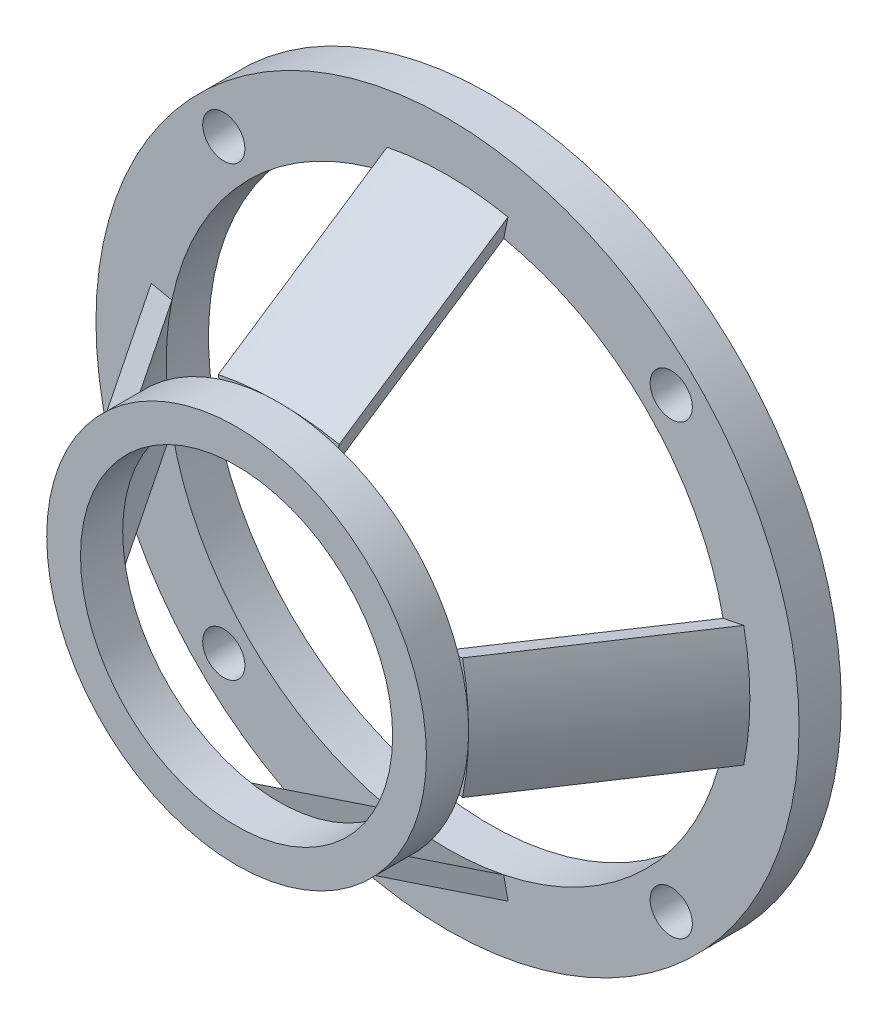
ISO-10303-21;
HEADER;
FILE_DESCRIPTION(('STEP AP214'),'2;1');
FILE_NAME('part.step','',(''),(''),'','','');
FILE_SCHEMA(('AUTOMOTIVE_DESIGN { 1 0 10303 214 1 1 1 1 }'));
ENDSEC;
DATA;
#1=APPLICATION_CONTEXT('core data for automotive mechanical design processes');
#2=APPLICATION_PROTOCOL_DEFINITION('international standard','automotive_design',2000,#1);
#3=PRODUCT_CONTEXT('',#1,'mechanical');
#4=PRODUCT('Part','Part','',(#3));
#5=PRODUCT_RELATED_PRODUCT_CATEGORY('part','',(#4));
#6=PRODUCT_DEFINITION_FORMATION('','',#4);
#7=PRODUCT_DEFINITION_CONTEXT('part definition',#1,'design');
#8=PRODUCT_DEFINITION('design','',#6,#7);
#9=PRODUCT_DEFINITION_SHAPE('','',#8);
#10=(LENGTH_UNIT() NAMED_UNIT(*) SI_UNIT(.MILLI.,.METRE.));
#11=(NAMED_UNIT(*) PLANE_ANGLE_UNIT() SI_UNIT($,.RADIAN.));
#12=(NAMED_UNIT(*) SI_UNIT($,.STERADIAN.) SOLID_ANGLE_UNIT());
#13=UNCERTAINTY_MEASURE_WITH_UNIT(LENGTH_MEASURE(1.E-05),#10,'distance_accuracy_value','');
#14=(GEOMETRIC_REPRESENTATION_CONTEXT(3) GLOBAL_UNCERTAINTY_ASSIGNED_CONTEXT((#13)) GLOBAL_UNIT_ASSIGNED_CONTEXT((#10,
#11,#12)) REPRESENTATION_CONTEXT('',''));
#15=CARTESIAN_POINT('',(0.,0.,0.));
#16=DIRECTION('',(0.,0.,1.));
#17=DIRECTION('',(1.,0.,0.));
#18=AXIS2_PLACEMENT_3D('',#15,#16,#17);
#19=CARTESIAN_POINT('',(0.,-8.,15.));
#20=DIRECTION('',(0.,0.,1.));
#21=DIRECTION('',(1.,0.,0.));
#22=AXIS2_PLACEMENT_3D('',#19,#20,#21);
#23=PLANE('',#22);
#24=CARTESIAN_POINT('',(0.,0.,15.));
#25=DIRECTION('',(0.,0.,1.));
#26=DIRECTION('',(1.,0.,0.));
#27=AXIS2_PLACEMENT_3D('',#24,#25,#26);
#28=CIRCLE('',#27,13.5);
#29=CARTESIAN_POINT('',(4.24864340910343,12.8140169026844,15.));
#30=VERTEX_POINT('',#29);
#31=CARTESIAN_POINT('',(0.,13.5,15.));
#32=VERTEX_POINT('',#31);
#33=EDGE_CURVE('E44',#30,#32,#28,.T.);
#34=ORIENTED_EDGE('',*,*,#33,.F.);
#35=DIRECTION('',(0.199999999999999,0.979795897113272,0.));
#36=VECTOR('',#35,1.);
#37=CARTESIAN_POINT('',(4.,11.5959179422654,15.));
#38=LINE('',#37,#36);
#39=CARTESIAN_POINT('',(4.3,13.0656117879353,15.));
#40=VERTEX_POINT('',#39);
#41=EDGE_CURVE('E346',#30,#40,#38,.T.);
#42=ORIENTED_EDGE('',*,*,#41,.T.);
#43=CARTESIAN_POINT('',(0.,-8.,15.));
#44=DIRECTION('',(0.,0.,1.));
#45=DIRECTION('',(1.,0.,0.));
#46=AXIS2_PLACEMENT_3D('',#43,#44,#45);
#47=CIRCLE('',#46,21.5);
#48=EDGE_CURVE('E321',#40,#32,#47,.T.);
#49=ORIENTED_EDGE('',*,*,#48,.T.);
#50=EDGE_LOOP('',(#34,#42,#49));
#51=FACE_BOUND('',#50,.T.);
#52=ADVANCED_FACE('F33',(#51),#23,.T.);
#53=CARTESIAN_POINT('',(0.,0.,3.));
#54=DIRECTION('',(0.,0.,1.));
#55=DIRECTION('',(1.,0.,0.));
#56=AXIS2_PLACEMENT_3D('',#53,#54,#55);
#57=PLANE('',#56);
#58=CARTESIAN_POINT('',(-15.9099025766973,15.9099025766973,3.));
#59=DIRECTION('',(0.,0.,1.));
#60=DIRECTION('',(0.,1.,0.));
#61=AXIS2_PLACEMENT_3D('',#58,#59,#60);
#62=CIRCLE('',#61,1.5);
#63=CARTESIAN_POINT('',(-15.9099025766974,17.4099025766973,3.));
#64=VERTEX_POINT('',#63);
#65=EDGE_CURVE('E559',#64,#64,#62,.T.);
#66=ORIENTED_EDGE('',*,*,#65,.F.);
#67=EDGE_LOOP('',(#66));
#68=FACE_BOUND('',#67,.T.);
#69=CARTESIAN_POINT('',(-15.9099025766973,-15.9099025766973,3.));
#70=DIRECTION('',(0.,0.,1.));
#71=DIRECTION('',(-1.,0.,0.));
#72=AXIS2_PLACEMENT_3D('',#69,#70,#71);
#73=CIRCLE('',#72,1.5);
#74=CARTESIAN_POINT('',(-17.4099025766973,-15.9099025766973,3.));
#75=VERTEX_POINT('',#74);
#76=EDGE_CURVE('E564',#75,#75,#73,.T.);
#77=ORIENTED_EDGE('',*,*,#76,.F.);
#78=EDGE_LOOP('',(#77));
#79=FACE_BOUND('',#78,.T.);
#80=CARTESIAN_POINT('',(15.9099025766975,-15.9099025766972,3.));
#81=DIRECTION('',(0.,0.,1.));
#82=DIRECTION('',(0.,-1.,0.));
#83=AXIS2_PLACEMENT_3D('',#80,#81,#82);
#84=CIRCLE('',#83,1.5);
#85=CARTESIAN_POINT('',(15.9099025766975,-17.4099025766972,3.));
#86=VERTEX_POINT('',#85);
#87=EDGE_CURVE('E572',#86,#86,#84,.T.);
#88=ORIENTED_EDGE('',*,*,#87,.F.);
#89=EDGE_LOOP('',(#88));
#90=FACE_BOUND('',#89,.T.);
#91=CARTESIAN_POINT('',(15.9099025766973,15.9099025766973,3.));
#92=DIRECTION('',(0.,0.,1.));
#93=DIRECTION('',(1.,0.,0.));
#94=AXIS2_PLACEMENT_3D('',#91,#92,#93);
#95=CIRCLE('',#94,1.5);
#96=CARTESIAN_POINT('',(17.4099025766973,15.9099025766973,3.));
#97=VERTEX_POINT('',#96);
#98=EDGE_CURVE('E216',#97,#97,#95,.T.);
#99=ORIENTED_EDGE('',*,*,#98,.F.);
#100=EDGE_LOOP('',(#99));
#101=FACE_BOUND('',#100,.T.);
#102=DIRECTION('',(-0.979795897113269,-0.20000000000001,0.));
#103=VECTOR('',#102,1.);
#104=CARTESIAN_POINT('',(21.0656117879353,4.30000000000022,3.));
#105=LINE('',#104,#103);
#106=CARTESIAN_POINT('',(21.0656117879353,4.30000000000022,3.));
#107=VERTEX_POINT('',#106);
#108=CARTESIAN_POINT('',(19.5959179422654,4.00000000000021,3.));
#109=VERTEX_POINT('',#108);
#110=EDGE_CURVE('E211',#107,#109,#105,.T.);
#111=ORIENTED_EDGE('',*,*,#110,.F.);
#112=CARTESIAN_POINT('',(0.,0.,3.));
#113=DIRECTION('',(0.,0.,1.));
#114=DIRECTION('',(0.,-1.,0.));
#115=AXIS2_PLACEMENT_3D('',#112,#113,#114);
#116=CIRCLE('',#115,21.5);
#117=CARTESIAN_POINT('',(21.0656117879354,-4.29999999999978,3.));
#118=VERTEX_POINT('',#117);
#119=EDGE_CURVE('E203',#118,#107,#116,.T.);
#120=ORIENTED_EDGE('',*,*,#119,.F.);
#121=DIRECTION('',(0.979795897113274,-0.199999999999989,0.));
#122=VECTOR('',#121,1.);
#123=CARTESIAN_POINT('',(19.5959179422655,-3.99999999999979,3.));
#124=LINE('',#123,#122);
#125=CARTESIAN_POINT('',(19.5959179422655,-3.99999999999979,3.));
#126=VERTEX_POINT('',#125);
#127=EDGE_CURVE('E187',#126,#118,#124,.T.);
#128=ORIENTED_EDGE('',*,*,#127,.F.);
#129=CARTESIAN_POINT('',(0.,0.,3.));
#130=DIRECTION('',(0.,0.,1.));
#131=DIRECTION('',(1.,0.,0.));
#132=AXIS2_PLACEMENT_3D('',#129,#130,#131);
#133=CIRCLE('',#132,20.);
#134=CARTESIAN_POINT('',(4.00000000000001,-19.5959179422654,3.));
#135=VERTEX_POINT('',#134);
#136=EDGE_CURVE('E841',#135,#126,#133,.T.);
#137=ORIENTED_EDGE('',*,*,#136,.F.);
#138=DIRECTION('',(-0.2,0.979795897113271,0.));
#139=VECTOR('',#138,1.);
#140=CARTESIAN_POINT('',(4.3,-21.0656117879353,3.));
#141=LINE('',#140,#139);
#142=CARTESIAN_POINT('',(4.3,-21.0656117879353,3.));
#143=VERTEX_POINT('',#142);
#144=EDGE_CURVE('E239',#143,#135,#141,.T.);
#145=ORIENTED_EDGE('',*,*,#144,.F.);
#146=CARTESIAN_POINT('',(0.,0.,3.));
#147=DIRECTION('',(0.,0.,1.));
#148=DIRECTION('',(-1.,0.,0.));
#149=AXIS2_PLACEMENT_3D('',#146,#147,#148);
#150=CIRCLE('',#149,21.5);
#151=CARTESIAN_POINT('',(-4.3,-21.0656117879353,3.));
#152=VERTEX_POINT('',#151);
#153=EDGE_CURVE('E237',#152,#143,#150,.T.);
#154=ORIENTED_EDGE('',*,*,#153,.F.);
#155=DIRECTION('',(-0.199999999999999,-0.979795897113272,0.));
#156=VECTOR('',#155,1.);
#157=CARTESIAN_POINT('',(-4.,-19.5959179422654,3.));
#158=LINE('',#157,#156);
#159=CARTESIAN_POINT('',(-4.,-19.5959179422654,3.));
#160=VERTEX_POINT('',#159);
#161=EDGE_CURVE('E251',#160,#152,#158,.T.);
#162=ORIENTED_EDGE('',*,*,#161,.F.);
#163=CARTESIAN_POINT('',(-19.5959179422654,-4.00000000000007,3.));
#164=VERTEX_POINT('',#163);
#165=EDGE_CURVE('E839',#164,#160,#133,.T.);
#166=ORIENTED_EDGE('',*,*,#165,.F.);
#167=DIRECTION('',(0.979795897113271,0.200000000000003,0.));
#168=VECTOR('',#167,1.);
#169=CARTESIAN_POINT('',(-21.0656117879353,-4.30000000000007,3.));
#170=LINE('',#169,#168);
#171=CARTESIAN_POINT('',(-21.0656117879353,-4.30000000000007,3.));
#172=VERTEX_POINT('',#171);
#173=EDGE_CURVE('E274',#172,#164,#170,.T.);
#174=ORIENTED_EDGE('',*,*,#173,.F.);
#175=CARTESIAN_POINT('',(0.,0.,3.));
#176=DIRECTION('',(0.,0.,1.));
#177=DIRECTION('',(0.,1.,0.));
#178=AXIS2_PLACEMENT_3D('',#175,#176,#177);
#179=CIRCLE('',#178,21.5);
#180=CARTESIAN_POINT('',(-21.0656117879353,4.29999999999992,3.));
#181=VERTEX_POINT('',#180);
#182=EDGE_CURVE('E272',#181,#172,#179,.T.);
#183=ORIENTED_EDGE('',*,*,#182,.F.);
#184=DIRECTION('',(-0.979795897113272,0.199999999999995,0.));
#185=VECTOR('',#184,1.);
#186=CARTESIAN_POINT('',(-19.5959179422654,3.99999999999993,3.));
#187=LINE('',#186,#185);
#188=CARTESIAN_POINT('',(-19.5959179422654,3.99999999999993,3.));
#189=VERTEX_POINT('',#188);
#190=EDGE_CURVE('E286',#189,#181,#187,.T.);
#191=ORIENTED_EDGE('',*,*,#190,.F.);
#192=CARTESIAN_POINT('',(-4.,19.5959179422654,3.));
#193=VERTEX_POINT('',#192);
#194=EDGE_CURVE('E355',#193,#189,#133,.T.);
#195=ORIENTED_EDGE('',*,*,#194,.F.);
#196=DIRECTION('',(0.2,-0.979795897113271,0.));
#197=VECTOR('',#196,1.);
#198=CARTESIAN_POINT('',(-4.3,21.0656117879353,3.));
#199=LINE('',#198,#197);
#200=CARTESIAN_POINT('',(-4.3,21.0656117879353,3.));
#201=VERTEX_POINT('',#200);
#202=EDGE_CURVE('E320',#201,#193,#199,.T.);
#203=ORIENTED_EDGE('',*,*,#202,.F.);
#204=CARTESIAN_POINT('',(0.,0.,3.));
#205=DIRECTION('',(0.,0.,1.));
#206=DIRECTION('',(1.,0.,0.));
#207=AXIS2_PLACEMENT_3D('',#204,#205,#206);
#208=CIRCLE('',#207,21.5);
#209=CARTESIAN_POINT('',(4.3,21.0656117879353,3.));
#210=VERTEX_POINT('',#209);
#211=EDGE_CURVE('E315',#210,#201,#208,.T.);
#212=ORIENTED_EDGE('',*,*,#211,.F.);
#213=DIRECTION('',(0.199999999999999,0.979795897113272,0.));
#214=VECTOR('',#213,1.);
#215=CARTESIAN_POINT('',(4.,19.5959179422654,3.));
#216=LINE('',#215,#214);
#217=CARTESIAN_POINT('',(4.,19.5959179422654,3.));
#218=VERTEX_POINT('',#217);
#219=EDGE_CURVE('E332',#218,#210,#216,.T.);
#220=ORIENTED_EDGE('',*,*,#219,.F.);
#221=EDGE_CURVE('E356',#109,#218,#133,.T.);
#222=ORIENTED_EDGE('',*,*,#221,.F.);
#223=EDGE_LOOP('',(#111,#120,#128,#137,#145,#154,#162,#166,#174,#183,#191,#195,#203,#212,#220,#222));
#224=FACE_BOUND('',#223,.T.);
#225=CARTESIAN_POINT('',(0.,0.,3.));
#226=DIRECTION('',(0.,0.,1.));
#227=DIRECTION('',(1.,0.,0.));
#228=AXIS2_PLACEMENT_3D('',#225,#226,#227);
#229=CIRCLE('',#228,25.);
#230=CARTESIAN_POINT('',(25.,0.,3.));
#231=VERTEX_POINT('',#230);
#232=EDGE_CURVE('E42',#231,#231,#229,.T.);
#233=ORIENTED_EDGE('',*,*,#232,.T.);
#234=EDGE_LOOP('',(#233));
#235=FACE_BOUND('',#234,.T.);
#236=ADVANCED_FACE('F208',(#68,#79,#90,#101,#224,#235),#57,.T.);
#237=CARTESIAN_POINT('',(0.,0.,0.));
#238=DIRECTION('',(0.,0.,1.));
#239=DIRECTION('',(1.,0.,0.));
#240=AXIS2_PLACEMENT_3D('',#237,#238,#239);
#241=PLANE('',#240);
#242=CARTESIAN_POINT('',(-15.9099025766973,15.9099025766973,0.));
#243=DIRECTION('',(0.,0.,1.));
#244=DIRECTION('',(0.,1.,0.));
#245=AXIS2_PLACEMENT_3D('',#242,#243,#244);
#246=CIRCLE('',#245,1.5);
#247=CARTESIAN_POINT('',(-15.9099025766974,17.4099025766973,0.));
#248=VERTEX_POINT('',#247);
#249=EDGE_CURVE('E556',#248,#248,#246,.T.);
#250=ORIENTED_EDGE('',*,*,#249,.T.);
#251=EDGE_LOOP('',(#250));
#252=FACE_BOUND('',#251,.T.);
#253=CARTESIAN_POINT('',(-15.9099025766973,-15.9099025766973,0.));
#254=DIRECTION('',(0.,0.,1.));
#255=DIRECTION('',(-1.,0.,0.));
#256=AXIS2_PLACEMENT_3D('',#253,#254,#255);
#257=CIRCLE('',#256,1.5);
#258=CARTESIAN_POINT('',(-17.4099025766973,-15.9099025766973,0.));
#259=VERTEX_POINT('',#258);
#260=EDGE_CURVE('E560',#259,#259,#257,.T.);
#261=ORIENTED_EDGE('',*,*,#260,.T.);
#262=EDGE_LOOP('',(#261));
#263=FACE_BOUND('',#262,.T.);
#264=CARTESIAN_POINT('',(15.9099025766975,-15.9099025766972,0.));
#265=DIRECTION('',(0.,0.,1.));
#266=DIRECTION('',(0.,-1.,0.));
#267=AXIS2_PLACEMENT_3D('',#264,#265,#266);
#268=CIRCLE('',#267,1.5);
#269=CARTESIAN_POINT('',(15.9099025766975,-17.4099025766972,0.));
#270=VERTEX_POINT('',#269);
#271=EDGE_CURVE('E569',#270,#270,#268,.T.);
#272=ORIENTED_EDGE('',*,*,#271,.T.);
#273=EDGE_LOOP('',(#272));
#274=FACE_BOUND('',#273,.T.);
#275=CARTESIAN_POINT('',(15.9099025766973,15.9099025766973,0.));
#276=DIRECTION('',(0.,0.,1.));
#277=DIRECTION('',(1.,0.,0.));
#278=AXIS2_PLACEMENT_3D('',#275,#276,#277);
#279=CIRCLE('',#278,1.5);
#280=CARTESIAN_POINT('',(17.4099025766973,15.9099025766973,0.));
#281=VERTEX_POINT('',#280);
#282=EDGE_CURVE('E212',#281,#281,#279,.T.);
#283=ORIENTED_EDGE('',*,*,#282,.T.);
#284=EDGE_LOOP('',(#283));
#285=FACE_BOUND('',#284,.T.);
#286=CARTESIAN_POINT('',(0.,0.,0.));
#287=DIRECTION('',(0.,0.,1.));
#288=DIRECTION('',(1.,0.,0.));
#289=AXIS2_PLACEMENT_3D('',#286,#287,#288);
#290=CIRCLE('',#289,25.);
#291=CARTESIAN_POINT('',(25.,0.,0.));
#292=VERTEX_POINT('',#291);
#293=EDGE_CURVE('E37',#292,#292,#290,.T.);
#294=ORIENTED_EDGE('',*,*,#293,.F.);
#295=EDGE_LOOP('',(#294));
#296=FACE_BOUND('',#295,.T.);
#297=CARTESIAN_POINT('',(0.,0.,0.));
#298=DIRECTION('',(0.,0.,1.));
#299=DIRECTION('',(1.,0.,0.));
#300=AXIS2_PLACEMENT_3D('',#297,#298,#299);
#301=CIRCLE('',#300,20.);
#302=CARTESIAN_POINT('',(20.,0.,0.));
#303=VERTEX_POINT('',#302);
#304=EDGE_CURVE('E352',#303,#303,#301,.T.);
#305=ORIENTED_EDGE('',*,*,#304,.T.);
#306=EDGE_LOOP('',(#305));
#307=FACE_BOUND('',#306,.T.);
#308=ADVANCED_FACE('F364',(#252,#263,#274,#285,#296,#307),#241,.F.);
#309=CARTESIAN_POINT('',(0.,0.,3.));
#310=DIRECTION('',(0.,0.,-1.));
#311=DIRECTION('',(-1.,0.,0.));
#312=AXIS2_PLACEMENT_3D('',#309,#310,#311);
#313=CYLINDRICAL_SURFACE('',#312,25.);
#314=ORIENTED_EDGE('',*,*,#232,.F.);
#315=EDGE_LOOP('',(#314));
#316=FACE_BOUND('',#315,.T.);
#317=ORIENTED_EDGE('',*,*,#293,.T.);
#318=EDGE_LOOP('',(#317));
#319=FACE_BOUND('',#318,.T.);
#320=ADVANCED_FACE('F35',(#316,#319),#313,.T.);
#321=CARTESIAN_POINT('',(0.,0.,3.));
#322=DIRECTION('',(0.,0.,-1.));
#323=DIRECTION('',(-1.,0.,0.));
#324=AXIS2_PLACEMENT_3D('',#321,#322,#323);
#325=CYLINDRICAL_SURFACE('',#324,20.);
#326=EDGE_CURVE('E353',#218,#193,#133,.T.);
#327=ORIENTED_EDGE('',*,*,#326,.T.);
#328=ORIENTED_EDGE('',*,*,#194,.T.);
#329=CARTESIAN_POINT('',(0.,0.,3.));
#330=DIRECTION('',(0.,0.,-1.));
#331=DIRECTION('',(0.,1.,0.));
#332=AXIS2_PLACEMENT_3D('',#329,#330,#331);
#333=CIRCLE('',#332,20.);
#334=EDGE_CURVE('E288',#164,#189,#333,.T.);
#335=ORIENTED_EDGE('',*,*,#334,.F.);
#336=ORIENTED_EDGE('',*,*,#165,.T.);
#337=CARTESIAN_POINT('',(0.,0.,3.));
#338=DIRECTION('',(0.,0.,-1.));
#339=DIRECTION('',(-1.,0.,0.));
#340=AXIS2_PLACEMENT_3D('',#337,#338,#339);
#341=CIRCLE('',#340,20.);
#342=EDGE_CURVE('E254',#135,#160,#341,.T.);
#343=ORIENTED_EDGE('',*,*,#342,.F.);
#344=ORIENTED_EDGE('',*,*,#136,.T.);
#345=CARTESIAN_POINT('',(0.,0.,3.));
#346=DIRECTION('',(0.,0.,-1.));
#347=DIRECTION('',(0.,-1.,0.));
#348=AXIS2_PLACEMENT_3D('',#345,#346,#347);
#349=CIRCLE('',#348,20.);
#350=EDGE_CURVE('E198',#109,#126,#349,.T.);
#351=ORIENTED_EDGE('',*,*,#350,.F.);
#352=ORIENTED_EDGE('',*,*,#221,.T.);
#353=EDGE_LOOP('',(#327,#328,#335,#336,#343,#344,#351,#352));
#354=FACE_BOUND('',#353,.T.);
#355=ORIENTED_EDGE('',*,*,#304,.F.);
#356=EDGE_LOOP('',(#355));
#357=FACE_BOUND('',#356,.T.);
#358=ADVANCED_FACE('F370',(#354,#357),#325,.F.);
#359=CARTESIAN_POINT('',(-4.24864340910343,12.8140169026844,15.));
#360=VERTEX_POINT('',#359);
#361=EDGE_CURVE('E11',#32,#360,#28,.T.);
#362=ORIENTED_EDGE('',*,*,#361,.F.);
#363=CARTESIAN_POINT('',(-4.3,13.0656117879353,15.));
#364=VERTEX_POINT('',#363);
#365=EDGE_CURVE('E325',#32,#364,#47,.T.);
#366=ORIENTED_EDGE('',*,*,#365,.T.);
#367=DIRECTION('',(0.2,-0.979795897113271,0.));
#368=VECTOR('',#367,1.);
#369=CARTESIAN_POINT('',(-4.3,13.0656117879353,15.));
#370=LINE('',#369,#368);
#371=EDGE_CURVE('E335',#364,#360,#370,.T.);
#372=ORIENTED_EDGE('',*,*,#371,.T.);
#373=EDGE_LOOP('',(#362,#366,#372));
#374=FACE_BOUND('',#373,.T.);
#375=ADVANCED_FACE('F372',(#374),#23,.T.);
#376=CARTESIAN_POINT('',(4.3,21.0656117879353,3.));
#377=CARTESIAN_POINT('',(4.3,13.0656117879353,15.));
#378=CARTESIAN_POINT('',(1.45290306872329,21.6467730154247,3.));
#379=CARTESIAN_POINT('',(1.45290306872328,13.6467730154246,15.));
#380=CARTESIAN_POINT('',(-1.45290306872329,21.6467730154246,3.));
#381=CARTESIAN_POINT('',(-1.45290306872329,13.6467730154246,15.));
#382=CARTESIAN_POINT('',(-4.3,21.0656117879353,3.));
#383=CARTESIAN_POINT('',(-4.3,13.0656117879353,15.));
#384=(BOUNDED_SURFACE() B_SPLINE_SURFACE(3,1,((#376,#377),(#378,#379),(#380,#381),(#382,#383)),
.UNSPECIFIED.,.F.,.F.,.F.) B_SPLINE_SURFACE_WITH_KNOTS((4,4),(2,2),(0.,1.),(0.,1.),
.UNSPECIFIED.) GEOMETRIC_REPRESENTATION_ITEM() RATIONAL_B_SPLINE_SURFACE(((1.,1.),
(0.986530598075514,0.986530598075514),(0.986530598075514,0.986530598075514),(1.,1.))) REPRESENTATION_ITEM('') SURFACE());
#385=DIRECTION('',(0.,-0.554700196225229,0.832050294337844));
#386=VECTOR('',#385,1.);
#387=CARTESIAN_POINT('',(-4.3,21.0656117879353,3.));
#388=LINE('',#387,#386);
#389=EDGE_CURVE('E324',#201,#364,#388,.T.);
#390=DIRECTION('',(0.,-0.554700196225229,0.832050294337844));
#391=VECTOR('',#390,1.);
#392=CARTESIAN_POINT('',(4.3,21.0656117879353,3.));
#393=LINE('',#392,#391);
#394=EDGE_CURVE('E329',#210,#40,#393,.T.);
#395=ORIENTED_EDGE('',*,*,#389,.T.);
#396=ORIENTED_EDGE('',*,*,#365,.F.);
#397=ORIENTED_EDGE('',*,*,#48,.F.);
#398=ORIENTED_EDGE('',*,*,#394,.F.);
#399=ORIENTED_EDGE('',*,*,#211,.T.);
#400=EDGE_LOOP('',(#395,#396,#397,#398,#399));
#401=FACE_BOUND('',#400,.T.);
#402=ADVANCED_FACE('F380',(#401),#384,.T.);
#403=CARTESIAN_POINT('',(-4.3,21.0656117879353,3.));
#404=DIRECTION('',(-0.971201030193047,-0.198245580136527,-0.132163720091018));
#405=DIRECTION('',(0.2,-0.979795897113271,0.));
#406=AXIS2_PLACEMENT_3D('',#403,#404,#405);
#407=PLANE('',#406);
#408=DIRECTION('',(0.,-0.554700196225229,0.832050294337844));
#409=VECTOR('',#408,1.);
#410=CARTESIAN_POINT('',(-4.,19.5959179422654,3.));
#411=LINE('',#410,#409);
#412=CARTESIAN_POINT('',(-4.,11.5959179422654,15.));
#413=VERTEX_POINT('',#412);
#414=EDGE_CURVE('E337',#193,#413,#411,.T.);
#415=ORIENTED_EDGE('',*,*,#414,.T.);
#416=EDGE_CURVE('E328',#360,#413,#370,.T.);
#417=ORIENTED_EDGE('',*,*,#416,.F.);
#418=ORIENTED_EDGE('',*,*,#371,.F.);
#419=ORIENTED_EDGE('',*,*,#389,.F.);
#420=ORIENTED_EDGE('',*,*,#202,.T.);
#421=EDGE_LOOP('',(#415,#417,#418,#419,#420));
#422=FACE_BOUND('',#421,.T.);
#423=ADVANCED_FACE('F402',(#422),#407,.T.);
#424=CARTESIAN_POINT('',(-4.00000000000001,19.5959179422654,3.));
#425=CARTESIAN_POINT('',(-4.00000000000001,11.5959179422654,15.));
#426=CARTESIAN_POINT('',(-1.35153773834725,20.1365330376043,3.));
#427=CARTESIAN_POINT('',(-1.35153773834725,12.1365330376043,15.));
#428=CARTESIAN_POINT('',(1.35153773834724,20.1365330376043,3.));
#429=CARTESIAN_POINT('',(1.35153773834724,12.1365330376043,15.));
#430=CARTESIAN_POINT('',(4.,19.5959179422654,3.));
#431=CARTESIAN_POINT('',(4.,11.5959179422654,15.));
#432=(BOUNDED_SURFACE() B_SPLINE_SURFACE(3,1,((#424,#425),(#426,#427),(#428,#429),(#430,#431)),
.UNSPECIFIED.,.F.,.F.,.F.) B_SPLINE_SURFACE_WITH_KNOTS((4,4),(2,2),(0.,1.),(0.,1.),
.UNSPECIFIED.) GEOMETRIC_REPRESENTATION_ITEM() RATIONAL_B_SPLINE_SURFACE(((1.,1.),
(0.986530598075514,0.986530598075514),(0.986530598075514,0.986530598075514),(1.,1.))) REPRESENTATION_ITEM('') SURFACE());
#433=DIRECTION('',(0.,-0.554700196225229,0.832050294337844));
#434=VECTOR('',#433,1.);
#435=CARTESIAN_POINT('',(4.,19.5959179422654,3.));
#436=LINE('',#435,#434);
#437=CARTESIAN_POINT('',(4.,11.5959179422654,15.));
#438=VERTEX_POINT('',#437);
#439=EDGE_CURVE('E343',#218,#438,#436,.T.);
#440=CARTESIAN_POINT('',(0.,-8.,15.));
#441=DIRECTION('',(0.,0.,-1.));
#442=DIRECTION('',(1.,0.,0.));
#443=AXIS2_PLACEMENT_3D('',#440,#441,#442);
#444=CIRCLE('',#443,20.);
#445=EDGE_CURVE('E340',#413,#438,#444,.T.);
#446=ORIENTED_EDGE('',*,*,#439,.T.);
#447=ORIENTED_EDGE('',*,*,#445,.F.);
#448=ORIENTED_EDGE('',*,*,#414,.F.);
#449=ORIENTED_EDGE('',*,*,#326,.F.);
#450=EDGE_LOOP('',(#446,#447,#448,#449));
#451=FACE_BOUND('',#450,.T.);
#452=ADVANCED_FACE('F387',(#451),#432,.T.);
#453=CARTESIAN_POINT('',(4.,19.5959179422654,3.));
#454=DIRECTION('',(0.971201030193047,-0.198245580136526,-0.132163720091017));
#455=DIRECTION('',(0.199999999999999,0.979795897113271,0.));
#456=AXIS2_PLACEMENT_3D('',#453,#454,#455);
#457=PLANE('',#456);
#458=EDGE_CURVE('E349',#438,#30,#38,.T.);
#459=ORIENTED_EDGE('',*,*,#458,.F.);
#460=ORIENTED_EDGE('',*,*,#439,.F.);
#461=ORIENTED_EDGE('',*,*,#219,.T.);
#462=ORIENTED_EDGE('',*,*,#394,.T.);
#463=ORIENTED_EDGE('',*,*,#41,.F.);
#464=EDGE_LOOP('',(#459,#460,#461,#462,#463));
#465=FACE_BOUND('',#464,.T.);
#466=ADVANCED_FACE('F375',(#465),#457,.T.);
#467=CARTESIAN_POINT('',(0.,0.,15.));
#468=DIRECTION('',(0.,0.,1.));
#469=DIRECTION('',(1.,0.,0.));
#470=AXIS2_PLACEMENT_3D('',#467,#468,#469);
#471=PLANE('',#470);
#472=CARTESIAN_POINT('',(0.,0.,15.));
#473=DIRECTION('',(0.,0.,1.));
#474=DIRECTION('',(1.,0.,0.));
#475=AXIS2_PLACEMENT_3D('',#472,#473,#474);
#476=CIRCLE('',#475,11.1);
#477=CARTESIAN_POINT('',(11.1,0.,15.));
#478=VERTEX_POINT('',#477);
#479=EDGE_CURVE('E306',#478,#478,#476,.T.);
#480=ORIENTED_EDGE('',*,*,#479,.T.);
#481=EDGE_LOOP('',(#480));
#482=FACE_BOUND('',#481,.T.);
#483=CARTESIAN_POINT('',(12.8140169026844,4.24864340910357,15.));
#484=VERTEX_POINT('',#483);
#485=EDGE_CURVE('E310',#484,#30,#28,.T.);
#486=ORIENTED_EDGE('',*,*,#485,.F.);
#487=DIRECTION('',(-0.979795897113269,-0.20000000000001,0.));
#488=VECTOR('',#487,1.);
#489=CARTESIAN_POINT('',(13.0656117879353,4.30000000000014,15.));
#490=LINE('',#489,#488);
#491=CARTESIAN_POINT('',(11.5959179422654,4.00000000000012,15.));
#492=VERTEX_POINT('',#491);
#493=EDGE_CURVE('E222',#484,#492,#490,.T.);
#494=ORIENTED_EDGE('',*,*,#493,.T.);
#495=CARTESIAN_POINT('',(-8.,0.,15.));
#496=DIRECTION('',(0.,0.,-1.));
#497=DIRECTION('',(0.,-1.,0.));
#498=AXIS2_PLACEMENT_3D('',#495,#496,#497);
#499=CIRCLE('',#498,20.);
#500=CARTESIAN_POINT('',(11.5959179422655,-3.99999999999988,15.));
#501=VERTEX_POINT('',#500);
#502=EDGE_CURVE('E228',#492,#501,#499,.T.);
#503=ORIENTED_EDGE('',*,*,#502,.T.);
#504=DIRECTION('',(0.979795897113274,-0.199999999999989,0.));
#505=VECTOR('',#504,1.);
#506=CARTESIAN_POINT('',(11.5959179422655,-3.99999999999988,15.));
#507=LINE('',#506,#505);
#508=CARTESIAN_POINT('',(12.8140169026845,-4.24864340910329,15.));
#509=VERTEX_POINT('',#508);
#510=EDGE_CURVE('E234',#501,#509,#507,.T.);
#511=ORIENTED_EDGE('',*,*,#510,.T.);
#512=CARTESIAN_POINT('',(4.24864340910343,-12.8140169026844,15.));
#513=VERTEX_POINT('',#512);
#514=EDGE_CURVE('E853',#513,#509,#28,.T.);
#515=ORIENTED_EDGE('',*,*,#514,.F.);
#516=DIRECTION('',(-0.2,0.979795897113271,0.));
#517=VECTOR('',#516,1.);
#518=CARTESIAN_POINT('',(4.3,-13.0656117879353,15.));
#519=LINE('',#518,#517);
#520=CARTESIAN_POINT('',(4.,-11.5959179422654,15.));
#521=VERTEX_POINT('',#520);
#522=EDGE_CURVE('E247',#513,#521,#519,.T.);
#523=ORIENTED_EDGE('',*,*,#522,.T.);
#524=CARTESIAN_POINT('',(0.,8.,15.));
#525=DIRECTION('',(0.,0.,-1.));
#526=DIRECTION('',(-1.,0.,0.));
#527=AXIS2_PLACEMENT_3D('',#524,#525,#526);
#528=CIRCLE('',#527,20.);
#529=CARTESIAN_POINT('',(-4.,-11.5959179422654,15.));
#530=VERTEX_POINT('',#529);
#531=EDGE_CURVE('E260',#521,#530,#528,.T.);
#532=ORIENTED_EDGE('',*,*,#531,.T.);
#533=DIRECTION('',(-0.199999999999999,-0.979795897113272,0.));
#534=VECTOR('',#533,1.);
#535=CARTESIAN_POINT('',(-4.,-11.5959179422654,15.));
#536=LINE('',#535,#534);
#537=CARTESIAN_POINT('',(-4.24864340910343,-12.8140169026844,15.));
#538=VERTEX_POINT('',#537);
#539=EDGE_CURVE('E269',#530,#538,#536,.T.);
#540=ORIENTED_EDGE('',*,*,#539,.T.);
#541=CARTESIAN_POINT('',(-12.8140169026844,-4.24864340910348,15.));
#542=VERTEX_POINT('',#541);
#543=EDGE_CURVE('E857',#542,#538,#28,.T.);
#544=ORIENTED_EDGE('',*,*,#543,.F.);
#545=DIRECTION('',(0.979795897113271,0.200000000000003,0.));
#546=VECTOR('',#545,1.);
#547=CARTESIAN_POINT('',(-13.0656117879353,-4.30000000000005,15.));
#548=LINE('',#547,#546);
#549=CARTESIAN_POINT('',(-11.5959179422654,-4.00000000000004,15.));
#550=VERTEX_POINT('',#549);
#551=EDGE_CURVE('E282',#542,#550,#548,.T.);
#552=ORIENTED_EDGE('',*,*,#551,.T.);
#553=CARTESIAN_POINT('',(8.,0.,15.));
#554=DIRECTION('',(0.,0.,-1.));
#555=DIRECTION('',(0.,1.,0.));
#556=AXIS2_PLACEMENT_3D('',#553,#554,#555);
#557=CIRCLE('',#556,20.);
#558=CARTESIAN_POINT('',(-11.5959179422654,3.99999999999996,15.));
#559=VERTEX_POINT('',#558);
#560=EDGE_CURVE('E294',#550,#559,#557,.T.);
#561=ORIENTED_EDGE('',*,*,#560,.T.);
#562=DIRECTION('',(-0.979795897113272,0.199999999999995,0.));
#563=VECTOR('',#562,1.);
#564=CARTESIAN_POINT('',(-11.5959179422654,3.99999999999996,15.));
#565=LINE('',#564,#563);
#566=CARTESIAN_POINT('',(-12.8140169026844,4.24864340910338,15.));
#567=VERTEX_POINT('',#566);
#568=EDGE_CURVE('E303',#559,#567,#565,.T.);
#569=ORIENTED_EDGE('',*,*,#568,.T.);
#570=EDGE_CURVE('E45',#360,#567,#28,.T.);
#571=ORIENTED_EDGE('',*,*,#570,.F.);
#572=ORIENTED_EDGE('',*,*,#416,.T.);
#573=ORIENTED_EDGE('',*,*,#445,.T.);
#574=ORIENTED_EDGE('',*,*,#458,.T.);
#575=EDGE_LOOP('',(#486,#494,#503,#511,#515,#523,#532,#540,#544,#552,#561,#569,#571,#572,#573,#574));
#576=FACE_BOUND('',#575,.T.);
#577=ADVANCED_FACE('F383',(#482,#576),#471,.F.);
#578=CARTESIAN_POINT('',(0.,0.,18.));
#579=DIRECTION('',(0.,0.,1.));
#580=DIRECTION('',(1.,0.,0.));
#581=AXIS2_PLACEMENT_3D('',#578,#579,#580);
#582=PLANE('',#581);
#583=CARTESIAN_POINT('',(0.,0.,18.));
#584=DIRECTION('',(0.,0.,1.));
#585=DIRECTION('',(1.,0.,0.));
#586=AXIS2_PLACEMENT_3D('',#583,#584,#585);
#587=CIRCLE('',#586,13.5);
#588=CARTESIAN_POINT('',(13.5,0.,18.));
#589=VERTEX_POINT('',#588);
#590=EDGE_CURVE('E313',#589,#589,#587,.T.);
#591=ORIENTED_EDGE('',*,*,#590,.T.);
#592=EDGE_LOOP('',(#591));
#593=FACE_BOUND('',#592,.T.);
#594=CARTESIAN_POINT('',(0.,0.,18.));
#595=DIRECTION('',(0.,0.,1.));
#596=DIRECTION('',(1.,0.,0.));
#597=AXIS2_PLACEMENT_3D('',#594,#595,#596);
#598=CIRCLE('',#597,11.1);
#599=CARTESIAN_POINT('',(11.1,0.,18.));
#600=VERTEX_POINT('',#599);
#601=EDGE_CURVE('E307',#600,#600,#598,.T.);
#602=ORIENTED_EDGE('',*,*,#601,.F.);
#603=EDGE_LOOP('',(#602));
#604=FACE_BOUND('',#603,.T.);
#605=ADVANCED_FACE('F426',(#593,#604),#582,.T.);
#606=CARTESIAN_POINT('',(0.,0.,18.));
#607=DIRECTION('',(0.,0.,-1.));
#608=DIRECTION('',(-1.,0.,0.));
#609=AXIS2_PLACEMENT_3D('',#606,#607,#608);
#610=CYLINDRICAL_SURFACE('',#609,13.5);
#611=ORIENTED_EDGE('',*,*,#590,.F.);
#612=EDGE_LOOP('',(#611));
#613=FACE_BOUND('',#612,.T.);
#614=ORIENTED_EDGE('',*,*,#33,.T.);
#615=ORIENTED_EDGE('',*,*,#361,.T.);
#616=ORIENTED_EDGE('',*,*,#570,.T.);
#617=CARTESIAN_POINT('',(-13.5,0.,15.));
#618=VERTEX_POINT('',#617);
#619=EDGE_CURVE('E807',#567,#618,#28,.T.);
#620=ORIENTED_EDGE('',*,*,#619,.T.);
#621=EDGE_CURVE('E813',#618,#542,#28,.T.);
#622=ORIENTED_EDGE('',*,*,#621,.T.);
#623=ORIENTED_EDGE('',*,*,#543,.T.);
#624=CARTESIAN_POINT('',(0.,-13.5,15.));
#625=VERTEX_POINT('',#624);
#626=EDGE_CURVE('E855',#538,#625,#28,.T.);
#627=ORIENTED_EDGE('',*,*,#626,.T.);
#628=EDGE_CURVE('E854',#625,#513,#28,.T.);
#629=ORIENTED_EDGE('',*,*,#628,.T.);
#630=ORIENTED_EDGE('',*,*,#514,.T.);
#631=CARTESIAN_POINT('',(13.5,1.45451406092936E-13,15.));
#632=VERTEX_POINT('',#631);
#633=EDGE_CURVE('E851',#509,#632,#28,.T.);
#634=ORIENTED_EDGE('',*,*,#633,.T.);
#635=EDGE_CURVE('E849',#632,#484,#28,.T.);
#636=ORIENTED_EDGE('',*,*,#635,.T.);
#637=ORIENTED_EDGE('',*,*,#485,.T.);
#638=EDGE_LOOP('',(#614,#615,#616,#620,#622,#623,#627,#629,#630,#634,#636,#637));
#639=FACE_BOUND('',#638,.T.);
#640=ADVANCED_FACE('F417',(#613,#639),#610,.T.);
#641=CARTESIAN_POINT('',(0.,0.,18.));
#642=DIRECTION('',(0.,0.,-1.));
#643=DIRECTION('',(-1.,0.,0.));
#644=AXIS2_PLACEMENT_3D('',#641,#642,#643);
#645=CYLINDRICAL_SURFACE('',#644,11.1);
#646=ORIENTED_EDGE('',*,*,#601,.T.);
#647=EDGE_LOOP('',(#646));
#648=FACE_BOUND('',#647,.T.);
#649=ORIENTED_EDGE('',*,*,#479,.F.);
#650=EDGE_LOOP('',(#649));
#651=FACE_BOUND('',#650,.T.);
#652=ADVANCED_FACE('F425',(#648,#651),#645,.F.);
#653=CARTESIAN_POINT('',(8.,0.,15.));
#654=DIRECTION('',(0.,0.,1.));
#655=DIRECTION('',(0.,1.,0.));
#656=AXIS2_PLACEMENT_3D('',#653,#654,#655);
#657=PLANE('',#656);
#658=ORIENTED_EDGE('',*,*,#619,.F.);
#659=CARTESIAN_POINT('',(-13.0656117879353,4.29999999999995,15.));
#660=VERTEX_POINT('',#659);
#661=EDGE_CURVE('E301',#567,#660,#565,.T.);
#662=ORIENTED_EDGE('',*,*,#661,.T.);
#663=CARTESIAN_POINT('',(8.,0.,15.));
#664=DIRECTION('',(0.,0.,1.));
#665=DIRECTION('',(0.,1.,0.));
#666=AXIS2_PLACEMENT_3D('',#663,#664,#665);
#667=CIRCLE('',#666,21.5);
#668=EDGE_CURVE('E275',#660,#618,#667,.T.);
#669=ORIENTED_EDGE('',*,*,#668,.T.);
#670=EDGE_LOOP('',(#658,#662,#669));
#671=FACE_BOUND('',#670,.T.);
#672=ADVANCED_FACE('F436',(#671),#657,.T.);
#673=ORIENTED_EDGE('',*,*,#621,.F.);
#674=CARTESIAN_POINT('',(-13.0656117879353,-4.30000000000005,15.));
#675=VERTEX_POINT('',#674);
#676=EDGE_CURVE('E279',#618,#675,#667,.T.);
#677=ORIENTED_EDGE('',*,*,#676,.T.);
#678=EDGE_CURVE('E289',#675,#542,#548,.T.);
#679=ORIENTED_EDGE('',*,*,#678,.T.);
#680=EDGE_LOOP('',(#673,#677,#679));
#681=FACE_BOUND('',#680,.T.);
#682=ADVANCED_FACE('F438',(#681),#657,.T.);
#683=CARTESIAN_POINT('',(-21.0656117879353,4.29999999999993,3.));
#684=CARTESIAN_POINT('',(-13.0656117879353,4.29999999999995,15.));
#685=CARTESIAN_POINT('',(-21.6467730154247,1.45290306872321,3.));
#686=CARTESIAN_POINT('',(-13.6467730154247,1.45290306872324,15.));
#687=CARTESIAN_POINT('',(-21.6467730154246,-1.45290306872336,3.));
#688=CARTESIAN_POINT('',(-13.6467730154246,-1.45290306872334,15.));
#689=CARTESIAN_POINT('',(-21.0656117879353,-4.30000000000007,3.));
#690=CARTESIAN_POINT('',(-13.0656117879353,-4.30000000000005,15.));
#691=(BOUNDED_SURFACE() B_SPLINE_SURFACE(3,1,((#683,#684),(#685,#686),(#687,#688),(#689,#690)),
.UNSPECIFIED.,.F.,.F.,.F.) B_SPLINE_SURFACE_WITH_KNOTS((4,4),(2,2),(0.,1.),(0.,1.),
.UNSPECIFIED.) GEOMETRIC_REPRESENTATION_ITEM() RATIONAL_B_SPLINE_SURFACE(((1.,1.),
(0.986530598075514,0.986530598075514),(0.986530598075514,0.986530598075514),(1.,1.))) REPRESENTATION_ITEM('') SURFACE());
#692=DIRECTION('',(0.554700196225229,0.,0.832050294337844));
#693=VECTOR('',#692,1.);
#694=CARTESIAN_POINT('',(-21.0656117879353,-4.30000000000007,3.));
#695=LINE('',#694,#693);
#696=EDGE_CURVE('E278',#172,#675,#695,.T.);
#697=DIRECTION('',(0.554700196225229,0.,0.832050294337844));
#698=VECTOR('',#697,1.);
#699=CARTESIAN_POINT('',(-21.0656117879353,4.29999999999992,3.));
#700=LINE('',#699,#698);
#701=EDGE_CURVE('E283',#181,#660,#700,.T.);
#702=ORIENTED_EDGE('',*,*,#696,.T.);
#703=ORIENTED_EDGE('',*,*,#676,.F.);
#704=ORIENTED_EDGE('',*,*,#668,.F.);
#705=ORIENTED_EDGE('',*,*,#701,.F.);
#706=ORIENTED_EDGE('',*,*,#182,.T.);
#707=EDGE_LOOP('',(#702,#703,#704,#705,#706));
#708=FACE_BOUND('',#707,.T.);
#709=ADVANCED_FACE('F441',(#708),#691,.T.);
#710=CARTESIAN_POINT('',(-21.0656117879353,-4.30000000000007,3.));
#711=DIRECTION('',(0.19824558013653,-0.971201030193046,-0.132163720091018));
#712=DIRECTION('',(0.979795897113271,0.200000000000003,0.));
#713=AXIS2_PLACEMENT_3D('',#710,#711,#712);
#714=PLANE('',#713);
#715=DIRECTION('',(0.554700196225229,0.,0.832050294337844));
#716=VECTOR('',#715,1.);
#717=CARTESIAN_POINT('',(-19.5959179422654,-4.00000000000007,3.));
#718=LINE('',#717,#716);
#719=EDGE_CURVE('E291',#164,#550,#718,.T.);
#720=ORIENTED_EDGE('',*,*,#719,.T.);
#721=ORIENTED_EDGE('',*,*,#551,.F.);
#722=ORIENTED_EDGE('',*,*,#678,.F.);
#723=ORIENTED_EDGE('',*,*,#696,.F.);
#724=ORIENTED_EDGE('',*,*,#173,.T.);
#725=EDGE_LOOP('',(#720,#721,#722,#723,#724));
#726=FACE_BOUND('',#725,.T.);
#727=ADVANCED_FACE('F453',(#726),#714,.T.);
#728=CARTESIAN_POINT('',(-19.5959179422654,-4.00000000000007,3.));
#729=CARTESIAN_POINT('',(-11.5959179422654,-4.00000000000005,15.));
#730=CARTESIAN_POINT('',(-20.1365330376043,-1.35153773834732,3.));
#731=CARTESIAN_POINT('',(-12.1365330376043,-1.35153773834729,15.));
#732=CARTESIAN_POINT('',(-20.1365330376043,1.35153773834717,3.));
#733=CARTESIAN_POINT('',(-12.1365330376043,1.3515377383472,15.));
#734=CARTESIAN_POINT('',(-19.5959179422654,3.99999999999993,3.));
#735=CARTESIAN_POINT('',(-11.5959179422654,3.99999999999996,15.));
#736=(BOUNDED_SURFACE() B_SPLINE_SURFACE(3,1,((#728,#729),(#730,#731),(#732,#733),(#734,#735)),
.UNSPECIFIED.,.F.,.F.,.F.) B_SPLINE_SURFACE_WITH_KNOTS((4,4),(2,2),(0.,1.),(0.,1.),
.UNSPECIFIED.) GEOMETRIC_REPRESENTATION_ITEM() RATIONAL_B_SPLINE_SURFACE(((1.,1.),
(0.986530598075514,0.986530598075514),(0.986530598075514,0.986530598075514),(1.,1.))) REPRESENTATION_ITEM('') SURFACE());
#737=DIRECTION('',(0.554700196225229,0.,0.832050294337844));
#738=VECTOR('',#737,1.);
#739=CARTESIAN_POINT('',(-19.5959179422654,3.99999999999993,3.));
#740=LINE('',#739,#738);
#741=EDGE_CURVE('E298',#189,#559,#740,.T.);
#742=ORIENTED_EDGE('',*,*,#741,.T.);
#743=ORIENTED_EDGE('',*,*,#560,.F.);
#744=ORIENTED_EDGE('',*,*,#719,.F.);
#745=ORIENTED_EDGE('',*,*,#334,.T.);
#746=EDGE_LOOP('',(#742,#743,#744,#745));
#747=FACE_BOUND('',#746,.T.);
#748=ADVANCED_FACE('F447',(#747),#736,.T.);
#749=CARTESIAN_POINT('',(-19.5959179422654,3.99999999999993,3.));
#750=DIRECTION('',(0.198245580136522,0.971201030193048,-0.132163720091017));
#751=DIRECTION('',(-0.979795897113272,0.199999999999995,0.));
#752=AXIS2_PLACEMENT_3D('',#749,#750,#751);
#753=PLANE('',#752);
#754=ORIENTED_EDGE('',*,*,#568,.F.);
#755=ORIENTED_EDGE('',*,*,#741,.F.);
#756=ORIENTED_EDGE('',*,*,#190,.T.);
#757=ORIENTED_EDGE('',*,*,#701,.T.);
#758=ORIENTED_EDGE('',*,*,#661,.F.);
#759=EDGE_LOOP('',(#754,#755,#756,#757,#758));
#760=FACE_BOUND('',#759,.T.);
#761=ADVANCED_FACE('F444',(#760),#753,.T.);
#762=CARTESIAN_POINT('',(0.,8.,15.));
#763=DIRECTION('',(0.,0.,1.));
#764=DIRECTION('',(-1.,0.,0.));
#765=AXIS2_PLACEMENT_3D('',#762,#763,#764);
#766=PLANE('',#765);
#767=ORIENTED_EDGE('',*,*,#626,.F.);
#768=CARTESIAN_POINT('',(-4.3,-13.0656117879353,15.));
#769=VERTEX_POINT('',#768);
#770=EDGE_CURVE('E267',#538,#769,#536,.T.);
#771=ORIENTED_EDGE('',*,*,#770,.T.);
#772=CARTESIAN_POINT('',(0.,8.,15.));
#773=DIRECTION('',(0.,0.,1.));
#774=DIRECTION('',(-1.,0.,0.));
#775=AXIS2_PLACEMENT_3D('',#772,#773,#774);
#776=CIRCLE('',#775,21.5);
#777=EDGE_CURVE('E240',#769,#625,#776,.T.);
#778=ORIENTED_EDGE('',*,*,#777,.T.);
#779=EDGE_LOOP('',(#767,#771,#778));
#780=FACE_BOUND('',#779,.T.);
#781=ADVANCED_FACE('F443',(#780),#766,.T.);
#782=ORIENTED_EDGE('',*,*,#628,.F.);
#783=CARTESIAN_POINT('',(4.3,-13.0656117879353,15.));
#784=VERTEX_POINT('',#783);
#785=EDGE_CURVE('E244',#625,#784,#776,.T.);
#786=ORIENTED_EDGE('',*,*,#785,.T.);
#787=EDGE_CURVE('E255',#784,#513,#519,.T.);
#788=ORIENTED_EDGE('',*,*,#787,.T.);
#789=EDGE_LOOP('',(#782,#786,#788));
#790=FACE_BOUND('',#789,.T.);
#791=ADVANCED_FACE('F468',(#790),#766,.T.);
#792=CARTESIAN_POINT('',(-4.3,-21.0656117879353,3.));
#793=CARTESIAN_POINT('',(-4.3,-13.0656117879353,15.));
#794=CARTESIAN_POINT('',(-1.45290306872329,-21.6467730154247,3.));
#795=CARTESIAN_POINT('',(-1.45290306872328,-13.6467730154246,15.));
#796=CARTESIAN_POINT('',(1.45290306872329,-21.6467730154246,3.));
#797=CARTESIAN_POINT('',(1.45290306872329,-13.6467730154246,15.));
#798=CARTESIAN_POINT('',(4.3,-21.0656117879353,3.));
#799=CARTESIAN_POINT('',(4.3,-13.0656117879353,15.));
#800=(BOUNDED_SURFACE() B_SPLINE_SURFACE(3,1,((#792,#793),(#794,#795),(#796,#797),(#798,#799)),
.UNSPECIFIED.,.F.,.F.,.F.) B_SPLINE_SURFACE_WITH_KNOTS((4,4),(2,2),(0.,1.),(0.,1.),
.UNSPECIFIED.) GEOMETRIC_REPRESENTATION_ITEM() RATIONAL_B_SPLINE_SURFACE(((1.,1.),
(0.986530598075514,0.986530598075514),(0.986530598075514,0.986530598075514),(1.,1.))) REPRESENTATION_ITEM('') SURFACE());
#801=DIRECTION('',(0.,0.554700196225229,0.832050294337844));
#802=VECTOR('',#801,1.);
#803=CARTESIAN_POINT('',(4.3,-21.0656117879353,3.));
#804=LINE('',#803,#802);
#805=EDGE_CURVE('E243',#143,#784,#804,.T.);
#806=DIRECTION('',(0.,0.554700196225229,0.832050294337844));
#807=VECTOR('',#806,1.);
#808=CARTESIAN_POINT('',(-4.3,-21.0656117879353,3.));
#809=LINE('',#808,#807);
#810=EDGE_CURVE('E248',#152,#769,#809,.T.);
#811=ORIENTED_EDGE('',*,*,#805,.T.);
#812=ORIENTED_EDGE('',*,*,#785,.F.);
#813=ORIENTED_EDGE('',*,*,#777,.F.);
#814=ORIENTED_EDGE('',*,*,#810,.F.);
#815=ORIENTED_EDGE('',*,*,#153,.T.);
#816=EDGE_LOOP('',(#811,#812,#813,#814,#815));
#817=FACE_BOUND('',#816,.T.);
#818=ADVANCED_FACE('F476',(#817),#800,.T.);
#819=CARTESIAN_POINT('',(4.3,-21.0656117879353,3.));
#820=DIRECTION('',(0.971201030193047,0.198245580136527,-0.132163720091018));
#821=DIRECTION('',(-0.2,0.979795897113271,0.));
#822=AXIS2_PLACEMENT_3D('',#819,#820,#821);
#823=PLANE('',#822);
#824=DIRECTION('',(0.,0.554700196225229,0.832050294337844));
#825=VECTOR('',#824,1.);
#826=CARTESIAN_POINT('',(4.,-19.5959179422654,3.));
#827=LINE('',#826,#825);
#828=EDGE_CURVE('E257',#135,#521,#827,.T.);
#829=ORIENTED_EDGE('',*,*,#828,.T.);
#830=ORIENTED_EDGE('',*,*,#522,.F.);
#831=ORIENTED_EDGE('',*,*,#787,.F.);
#832=ORIENTED_EDGE('',*,*,#805,.F.);
#833=ORIENTED_EDGE('',*,*,#144,.T.);
#834=EDGE_LOOP('',(#829,#830,#831,#832,#833));
#835=FACE_BOUND('',#834,.T.);
#836=ADVANCED_FACE('F488',(#835),#823,.T.);
#837=CARTESIAN_POINT('',(4.00000000000001,-19.5959179422654,3.));
#838=CARTESIAN_POINT('',(4.00000000000001,-11.5959179422654,15.));
#839=CARTESIAN_POINT('',(1.35153773834725,-20.1365330376043,3.));
#840=CARTESIAN_POINT('',(1.35153773834725,-12.1365330376043,15.));
#841=CARTESIAN_POINT('',(-1.35153773834724,-20.1365330376043,3.));
#842=CARTESIAN_POINT('',(-1.35153773834724,-12.1365330376043,15.));
#843=CARTESIAN_POINT('',(-4.,-19.5959179422654,3.));
#844=CARTESIAN_POINT('',(-4.,-11.5959179422654,15.));
#845=(BOUNDED_SURFACE() B_SPLINE_SURFACE(3,1,((#837,#838),(#839,#840),(#841,#842),(#843,#844)),
.UNSPECIFIED.,.F.,.F.,.F.) B_SPLINE_SURFACE_WITH_KNOTS((4,4),(2,2),(0.,1.),(0.,1.),
.UNSPECIFIED.) GEOMETRIC_REPRESENTATION_ITEM() RATIONAL_B_SPLINE_SURFACE(((1.,1.),
(0.986530598075514,0.986530598075514),(0.986530598075514,0.986530598075514),(1.,1.))) REPRESENTATION_ITEM('') SURFACE());
#846=DIRECTION('',(0.,0.554700196225229,0.832050294337844));
#847=VECTOR('',#846,1.);
#848=CARTESIAN_POINT('',(-4.,-19.5959179422654,3.));
#849=LINE('',#848,#847);
#850=EDGE_CURVE('E264',#160,#530,#849,.T.);
#851=ORIENTED_EDGE('',*,*,#850,.T.);
#852=ORIENTED_EDGE('',*,*,#531,.F.);
#853=ORIENTED_EDGE('',*,*,#828,.F.);
#854=ORIENTED_EDGE('',*,*,#342,.T.);
#855=EDGE_LOOP('',(#851,#852,#853,#854));
#856=FACE_BOUND('',#855,.T.);
#857=ADVANCED_FACE('F482',(#856),#845,.T.);
#858=CARTESIAN_POINT('',(-4.,-19.5959179422654,3.));
#859=DIRECTION('',(-0.971201030193047,0.198245580136526,-0.132163720091017));
#860=DIRECTION('',(-0.199999999999999,-0.979795897113271,0.));
#861=AXIS2_PLACEMENT_3D('',#858,#859,#860);
#862=PLANE('',#861);
#863=ORIENTED_EDGE('',*,*,#539,.F.);
#864=ORIENTED_EDGE('',*,*,#850,.F.);
#865=ORIENTED_EDGE('',*,*,#161,.T.);
#866=ORIENTED_EDGE('',*,*,#810,.T.);
#867=ORIENTED_EDGE('',*,*,#770,.F.);
#868=EDGE_LOOP('',(#863,#864,#865,#866,#867));
#869=FACE_BOUND('',#868,.T.);
#870=ADVANCED_FACE('F479',(#869),#862,.T.);
#871=CARTESIAN_POINT('',(-8.,0.,15.));
#872=DIRECTION('',(0.,0.,1.));
#873=DIRECTION('',(0.,-1.,0.));
#874=AXIS2_PLACEMENT_3D('',#871,#872,#873);
#875=PLANE('',#874);
#876=ORIENTED_EDGE('',*,*,#635,.F.);
#877=CARTESIAN_POINT('',(-8.,0.,15.));
#878=DIRECTION('',(0.,0.,1.));
#879=DIRECTION('',(0.,-1.,0.));
#880=AXIS2_PLACEMENT_3D('',#877,#878,#879);
#881=CIRCLE('',#880,21.5);
#882=CARTESIAN_POINT('',(13.0656117879353,4.30000000000014,15.));
#883=VERTEX_POINT('',#882);
#884=EDGE_CURVE('E205',#632,#883,#881,.T.);
#885=ORIENTED_EDGE('',*,*,#884,.T.);
#886=EDGE_CURVE('E224',#883,#484,#490,.T.);
#887=ORIENTED_EDGE('',*,*,#886,.T.);
#888=EDGE_LOOP('',(#876,#885,#887));
#889=FACE_BOUND('',#888,.T.);
#890=ADVANCED_FACE('F478',(#889),#875,.T.);
#891=ORIENTED_EDGE('',*,*,#633,.F.);
#892=CARTESIAN_POINT('',(13.0656117879354,-4.29999999999986,15.));
#893=VERTEX_POINT('',#892);
#894=EDGE_CURVE('E232',#509,#893,#507,.T.);
#895=ORIENTED_EDGE('',*,*,#894,.T.);
#896=EDGE_CURVE('E60',#893,#632,#881,.T.);
#897=ORIENTED_EDGE('',*,*,#896,.T.);
#898=EDGE_LOOP('',(#891,#895,#897));
#899=FACE_BOUND('',#898,.T.);
#900=ADVANCED_FACE('F503',(#899),#875,.T.);
#901=CARTESIAN_POINT('',(21.0656117879354,-4.29999999999978,3.));
#902=CARTESIAN_POINT('',(13.0656117879354,-4.29999999999986,15.));
#903=CARTESIAN_POINT('',(21.6467730154247,-1.45290306872306,3.));
#904=CARTESIAN_POINT('',(13.6467730154247,-1.45290306872314,15.));
#905=CARTESIAN_POINT('',(21.6467730154246,1.45290306872351,3.));
#906=CARTESIAN_POINT('',(13.6467730154246,1.45290306872343,15.));
#907=CARTESIAN_POINT('',(21.0656117879353,4.30000000000022,3.));
#908=CARTESIAN_POINT('',(13.0656117879353,4.30000000000014,15.));
#909=(BOUNDED_SURFACE() B_SPLINE_SURFACE(3,1,((#901,#902),(#903,#904),(#905,#906),(#907,#908)),
.UNSPECIFIED.,.F.,.F.,.F.) B_SPLINE_SURFACE_WITH_KNOTS((4,4),(2,2),(0.,1.),(0.,1.),
.UNSPECIFIED.) GEOMETRIC_REPRESENTATION_ITEM() RATIONAL_B_SPLINE_SURFACE(((1.,1.),
(0.986530598075514,0.986530598075514),(0.986530598075514,0.986530598075514),(1.,1.))) REPRESENTATION_ITEM('') SURFACE());
#910=DIRECTION('',(-0.554700196225229,0.,0.832050294337844));
#911=VECTOR('',#910,1.);
#912=CARTESIAN_POINT('',(21.0656117879353,4.30000000000022,3.));
#913=LINE('',#912,#911);
#914=EDGE_CURVE('E221',#107,#883,#913,.T.);
#915=DIRECTION('',(-0.554700196225229,0.,0.832050294337844));
#916=VECTOR('',#915,1.);
#917=CARTESIAN_POINT('',(21.0656117879354,-4.29999999999978,3.));
#918=LINE('',#917,#916);
#919=EDGE_CURVE('E191',#118,#893,#918,.T.);
#920=ORIENTED_EDGE('',*,*,#914,.T.);
#921=ORIENTED_EDGE('',*,*,#884,.F.);
#922=ORIENTED_EDGE('',*,*,#896,.F.);
#923=ORIENTED_EDGE('',*,*,#919,.F.);
#924=ORIENTED_EDGE('',*,*,#119,.T.);
#925=EDGE_LOOP('',(#920,#921,#922,#923,#924));
#926=FACE_BOUND('',#925,.T.);
#927=ADVANCED_FACE('F202',(#926),#909,.T.);
#928=CARTESIAN_POINT('',(21.0656117879353,4.30000000000022,3.));
#929=DIRECTION('',(-0.198245580136537,0.971201030193044,-0.132163720091018));
#930=DIRECTION('',(-0.979795897113269,-0.20000000000001,0.));
#931=AXIS2_PLACEMENT_3D('',#928,#929,#930);
#932=PLANE('',#931);
#933=DIRECTION('',(-0.554700196225229,0.,0.832050294337844));
#934=VECTOR('',#933,1.);
#935=CARTESIAN_POINT('',(19.5959179422654,4.00000000000021,3.));
#936=LINE('',#935,#934);
#937=EDGE_CURVE('E52',#109,#492,#936,.T.);
#938=ORIENTED_EDGE('',*,*,#937,.T.);
#939=ORIENTED_EDGE('',*,*,#493,.F.);
#940=ORIENTED_EDGE('',*,*,#886,.F.);
#941=ORIENTED_EDGE('',*,*,#914,.F.);
#942=ORIENTED_EDGE('',*,*,#110,.T.);
#943=EDGE_LOOP('',(#938,#939,#940,#941,#942));
#944=FACE_BOUND('',#943,.T.);
#945=ADVANCED_FACE('F519',(#944),#932,.T.);
#946=CARTESIAN_POINT('',(19.5959179422654,4.00000000000021,3.));
#947=CARTESIAN_POINT('',(11.5959179422654,4.00000000000013,15.));
#948=CARTESIAN_POINT('',(20.1365330376043,1.35153773834746,3.));
#949=CARTESIAN_POINT('',(12.1365330376043,1.35153773834738,15.));
#950=CARTESIAN_POINT('',(20.1365330376043,-1.35153773834703,3.));
#951=CARTESIAN_POINT('',(12.1365330376043,-1.35153773834711,15.));
#952=CARTESIAN_POINT('',(19.5959179422655,-3.99999999999979,3.));
#953=CARTESIAN_POINT('',(11.5959179422655,-3.99999999999988,15.));
#954=(BOUNDED_SURFACE() B_SPLINE_SURFACE(3,1,((#946,#947),(#948,#949),(#950,#951),(#952,#953)),
.UNSPECIFIED.,.F.,.F.,.F.) B_SPLINE_SURFACE_WITH_KNOTS((4,4),(2,2),(0.,1.),(0.,1.),
.UNSPECIFIED.) GEOMETRIC_REPRESENTATION_ITEM() RATIONAL_B_SPLINE_SURFACE(((1.,1.),
(0.986530598075514,0.986530598075514),(0.986530598075514,0.986530598075514),(1.,1.))) REPRESENTATION_ITEM('') SURFACE());
#955=DIRECTION('',(-0.554700196225229,0.,0.832050294337844));
#956=VECTOR('',#955,1.);
#957=CARTESIAN_POINT('',(19.5959179422655,-3.99999999999979,3.));
#958=LINE('',#957,#956);
#959=EDGE_CURVE('E193',#126,#501,#958,.T.);
#960=ORIENTED_EDGE('',*,*,#959,.T.);
#961=ORIENTED_EDGE('',*,*,#502,.F.);
#962=ORIENTED_EDGE('',*,*,#937,.F.);
#963=ORIENTED_EDGE('',*,*,#350,.T.);
#964=EDGE_LOOP('',(#960,#961,#962,#963));
#965=FACE_BOUND('',#964,.T.);
#966=ADVANCED_FACE('F514',(#965),#954,.T.);
#967=CARTESIAN_POINT('',(19.5959179422655,-3.99999999999979,3.));
#968=DIRECTION('',(-0.198245580136516,-0.971201030193049,-0.132163720091017));
#969=DIRECTION('',(0.979795897113274,-0.199999999999989,0.));
#970=AXIS2_PLACEMENT_3D('',#967,#968,#969);
#971=PLANE('',#970);
#972=ORIENTED_EDGE('',*,*,#510,.F.);
#973=ORIENTED_EDGE('',*,*,#959,.F.);
#974=ORIENTED_EDGE('',*,*,#127,.T.);
#975=ORIENTED_EDGE('',*,*,#919,.T.);
#976=ORIENTED_EDGE('',*,*,#894,.F.);
#977=EDGE_LOOP('',(#972,#973,#974,#975,#976));
#978=FACE_BOUND('',#977,.T.);
#979=ADVANCED_FACE('F189',(#978),#971,.T.);
#980=CARTESIAN_POINT('',(15.9099025766973,15.9099025766973,0.));
#981=DIRECTION('',(0.,0.,1.));
#982=DIRECTION('',(1.,0.,0.));
#983=AXIS2_PLACEMENT_3D('',#980,#981,#982);
#984=CYLINDRICAL_SURFACE('',#983,1.5);
#985=ORIENTED_EDGE('',*,*,#282,.F.);
#986=EDGE_LOOP('',(#985));
#987=FACE_BOUND('',#986,.T.);
#988=ORIENTED_EDGE('',*,*,#98,.T.);
#989=EDGE_LOOP('',(#988));
#990=FACE_BOUND('',#989,.T.);
#991=ADVANCED_FACE('F511',(#987,#990),#984,.F.);
#992=CARTESIAN_POINT('',(15.9099025766975,-15.9099025766972,0.));
#993=DIRECTION('',(0.,0.,1.));
#994=DIRECTION('',(1.,0.,0.));
#995=AXIS2_PLACEMENT_3D('',#992,#993,#994);
#996=CYLINDRICAL_SURFACE('',#995,1.5);
#997=ORIENTED_EDGE('',*,*,#271,.F.);
#998=EDGE_LOOP('',(#997));
#999=FACE_BOUND('',#998,.T.);
#1000=ORIENTED_EDGE('',*,*,#87,.T.);
#1001=EDGE_LOOP('',(#1000));
#1002=FACE_BOUND('',#1001,.T.);
#1003=ADVANCED_FACE('F539',(#999,#1002),#996,.F.);
#1004=CARTESIAN_POINT('',(-15.9099025766973,-15.9099025766973,0.));
#1005=DIRECTION('',(0.,0.,1.));
#1006=DIRECTION('',(1.,0.,0.));
#1007=AXIS2_PLACEMENT_3D('',#1004,#1005,#1006);
#1008=CYLINDRICAL_SURFACE('',#1007,1.5);
#1009=ORIENTED_EDGE('',*,*,#260,.F.);
#1010=EDGE_LOOP('',(#1009));
#1011=FACE_BOUND('',#1010,.T.);
#1012=ORIENTED_EDGE('',*,*,#76,.T.);
#1013=EDGE_LOOP('',(#1012));
#1014=FACE_BOUND('',#1013,.T.);
#1015=ADVANCED_FACE('F543',(#1011,#1014),#1008,.F.);
#1016=CARTESIAN_POINT('',(-15.9099025766973,15.9099025766973,0.));
#1017=DIRECTION('',(0.,0.,1.));
#1018=DIRECTION('',(1.,0.,0.));
#1019=AXIS2_PLACEMENT_3D('',#1016,#1017,#1018);
#1020=CYLINDRICAL_SURFACE('',#1019,1.5);
#1021=ORIENTED_EDGE('',*,*,#249,.F.);
#1022=EDGE_LOOP('',(#1021));
#1023=FACE_BOUND('',#1022,.T.);
#1024=ORIENTED_EDGE('',*,*,#65,.T.);
#1025=EDGE_LOOP('',(#1024));
#1026=FACE_BOUND('',#1025,.T.);
#1027=ADVANCED_FACE('F547',(#1023,#1026),#1020,.F.);
#1028=CLOSED_SHELL('',(#52,#236,#308,#320,#358,#375,#402,#423,#452,#466,#577,#605,#640,#652,
#672,#682,#709,#727,#748,#761,#781,#791,#818,#836,#857,#870,#890,#900,#927,#945,#966,#979,#991,
#1003,#1015,#1027));
#1029=MANIFOLD_SOLID_BREP('B2',#1028);
#1030=ADVANCED_BREP_SHAPE_REPRESENTATION('',(#18,#1029),#14);
#1031=SHAPE_DEFINITION_REPRESENTATION(#9,#1030);
ENDSEC;
END-ISO-10303-21;
